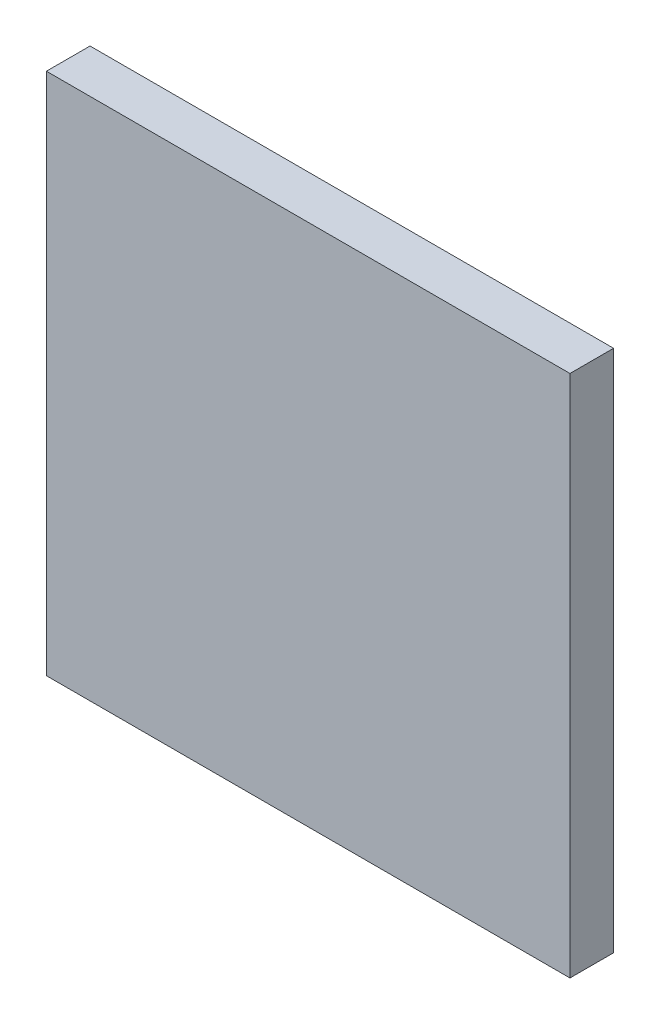
ISO-10303-21;
HEADER;
FILE_DESCRIPTION(('STEP AP214'),'2;1');
FILE_NAME('part.step','',(''),(''),'','','');
FILE_SCHEMA(('AUTOMOTIVE_DESIGN { 1 0 10303 214 1 1 1 1 }'));
ENDSEC;
DATA;
#1=APPLICATION_CONTEXT('core data for automotive mechanical design processes');
#2=APPLICATION_PROTOCOL_DEFINITION('international standard','automotive_design',2000,#1);
#3=PRODUCT_CONTEXT('',#1,'mechanical');
#4=PRODUCT('Part','Part','',(#3));
#5=PRODUCT_RELATED_PRODUCT_CATEGORY('part','',(#4));
#6=PRODUCT_DEFINITION_FORMATION('','',#4);
#7=PRODUCT_DEFINITION_CONTEXT('part definition',#1,'design');
#8=PRODUCT_DEFINITION('design','',#6,#7);
#9=PRODUCT_DEFINITION_SHAPE('','',#8);
#10=(LENGTH_UNIT() NAMED_UNIT(*) SI_UNIT(.MILLI.,.METRE.));
#11=(NAMED_UNIT(*) PLANE_ANGLE_UNIT() SI_UNIT($,.RADIAN.));
#12=(NAMED_UNIT(*) SI_UNIT($,.STERADIAN.) SOLID_ANGLE_UNIT());
#13=UNCERTAINTY_MEASURE_WITH_UNIT(LENGTH_MEASURE(1.E-05),#10,'distance_accuracy_value','');
#14=(GEOMETRIC_REPRESENTATION_CONTEXT(3) GLOBAL_UNCERTAINTY_ASSIGNED_CONTEXT((#13)) GLOBAL_UNIT_ASSIGNED_CONTEXT((#10,
#11,#12)) REPRESENTATION_CONTEXT('',''));
#15=CARTESIAN_POINT('',(0.,0.,0.));
#16=DIRECTION('',(0.,0.,1.));
#17=DIRECTION('',(1.,0.,0.));
#18=AXIS2_PLACEMENT_3D('',#15,#16,#17);
#19=CARTESIAN_POINT('',(76.2,-38.1,-3.175));
#20=DIRECTION('',(0.,0.,1.));
#21=DIRECTION('',(1.,0.,0.));
#22=AXIS2_PLACEMENT_3D('',#19,#20,#21);
#23=PLANE('',#22);
#24=DIRECTION('',(0.,1.,0.));
#25=VECTOR('',#24,1.);
#26=CARTESIAN_POINT('',(0.,-38.1,-3.175));
#27=LINE('',#26,#25);
#28=CARTESIAN_POINT('',(0.,-38.1,-3.175));
#29=VERTEX_POINT('',#28);
#30=CARTESIAN_POINT('',(0.,38.1,-3.175));
#31=VERTEX_POINT('',#30);
#32=EDGE_CURVE('E96',#29,#31,#27,.T.);
#33=ORIENTED_EDGE('',*,*,#32,.T.);
#34=DIRECTION('',(-1.,0.,0.));
#35=VECTOR('',#34,1.);
#36=CARTESIAN_POINT('',(76.2,38.1,-3.175));
#37=LINE('',#36,#35);
#38=CARTESIAN_POINT('',(76.2,38.1,-3.175));
#39=VERTEX_POINT('',#38);
#40=EDGE_CURVE('E11',#39,#31,#37,.T.);
#41=ORIENTED_EDGE('',*,*,#40,.F.);
#42=DIRECTION('',(0.,1.,0.));
#43=VECTOR('',#42,1.);
#44=CARTESIAN_POINT('',(76.2,-38.1,-3.175));
#45=LINE('',#44,#43);
#46=CARTESIAN_POINT('',(76.2,-38.1,-3.175));
#47=VERTEX_POINT('',#46);
#48=EDGE_CURVE('E84',#47,#39,#45,.T.);
#49=ORIENTED_EDGE('',*,*,#48,.F.);
#50=DIRECTION('',(-1.,0.,0.));
#51=VECTOR('',#50,1.);
#52=CARTESIAN_POINT('',(76.2,-38.1,-3.175));
#53=LINE('',#52,#51);
#54=EDGE_CURVE('E92',#47,#29,#53,.T.);
#55=ORIENTED_EDGE('',*,*,#54,.T.);
#56=EDGE_LOOP('',(#33,#41,#49,#55));
#57=FACE_BOUND('',#56,.T.);
#58=ADVANCED_FACE('F33',(#57),#23,.F.);
#59=CARTESIAN_POINT('',(76.2,38.1,3.175));
#60=DIRECTION('',(0.,-1.,0.));
#61=DIRECTION('',(0.,0.,-1.));
#62=AXIS2_PLACEMENT_3D('',#59,#60,#61);
#63=PLANE('',#62);
#64=DIRECTION('',(0.,0.,1.));
#65=VECTOR('',#64,1.);
#66=CARTESIAN_POINT('',(0.,38.1,3.175));
#67=LINE('',#66,#65);
#68=CARTESIAN_POINT('',(0.,38.1,3.175));
#69=VERTEX_POINT('',#68);
#70=EDGE_CURVE('E88',#31,#69,#67,.T.);
#71=ORIENTED_EDGE('',*,*,#70,.T.);
#72=DIRECTION('',(-1.,0.,0.));
#73=VECTOR('',#72,1.);
#74=CARTESIAN_POINT('',(76.2,38.1,3.175));
#75=LINE('',#74,#73);
#76=CARTESIAN_POINT('',(76.2,38.1,3.175));
#77=VERTEX_POINT('',#76);
#78=EDGE_CURVE('E41',#77,#69,#75,.T.);
#79=ORIENTED_EDGE('',*,*,#78,.F.);
#80=DIRECTION('',(0.,0.,1.));
#81=VECTOR('',#80,1.);
#82=CARTESIAN_POINT('',(76.2,38.1,3.175));
#83=LINE('',#82,#81);
#84=EDGE_CURVE('E79',#39,#77,#83,.T.);
#85=ORIENTED_EDGE('',*,*,#84,.F.);
#86=ORIENTED_EDGE('',*,*,#40,.T.);
#87=EDGE_LOOP('',(#71,#79,#85,#86));
#88=FACE_BOUND('',#87,.T.);
#89=ADVANCED_FACE('F87',(#88),#63,.F.);
#90=CARTESIAN_POINT('',(76.2,-38.1,3.175));
#91=DIRECTION('',(0.,0.,-1.));
#92=DIRECTION('',(-1.,0.,0.));
#93=AXIS2_PLACEMENT_3D('',#90,#91,#92);
#94=PLANE('',#93);
#95=DIRECTION('',(0.,-1.,0.));
#96=VECTOR('',#95,1.);
#97=CARTESIAN_POINT('',(0.,-38.1,3.175));
#98=LINE('',#97,#96);
#99=CARTESIAN_POINT('',(0.,-38.1,3.175));
#100=VERTEX_POINT('',#99);
#101=EDGE_CURVE('E66',#69,#100,#98,.T.);
#102=ORIENTED_EDGE('',*,*,#101,.T.);
#103=DIRECTION('',(-1.,0.,0.));
#104=VECTOR('',#103,1.);
#105=CARTESIAN_POINT('',(76.2,-38.1,3.175));
#106=LINE('',#105,#104);
#107=CARTESIAN_POINT('',(76.2,-38.1,3.175));
#108=VERTEX_POINT('',#107);
#109=EDGE_CURVE('E89',#108,#100,#106,.T.);
#110=ORIENTED_EDGE('',*,*,#109,.F.);
#111=DIRECTION('',(0.,-1.,0.));
#112=VECTOR('',#111,1.);
#113=CARTESIAN_POINT('',(76.2,-38.1,3.175));
#114=LINE('',#113,#112);
#115=EDGE_CURVE('E82',#77,#108,#114,.T.);
#116=ORIENTED_EDGE('',*,*,#115,.F.);
#117=ORIENTED_EDGE('',*,*,#78,.T.);
#118=EDGE_LOOP('',(#102,#110,#116,#117));
#119=FACE_BOUND('',#118,.T.);
#120=ADVANCED_FACE('F90',(#119),#94,.F.);
#121=CARTESIAN_POINT('',(76.2,-38.1,3.175));
#122=DIRECTION('',(0.,1.,0.));
#123=DIRECTION('',(0.,0.,1.));
#124=AXIS2_PLACEMENT_3D('',#121,#122,#123);
#125=PLANE('',#124);
#126=DIRECTION('',(0.,0.,-1.));
#127=VECTOR('',#126,1.);
#128=CARTESIAN_POINT('',(0.,-38.1,3.175));
#129=LINE('',#128,#127);
#130=EDGE_CURVE('E72',#100,#29,#129,.T.);
#131=ORIENTED_EDGE('',*,*,#130,.T.);
#132=ORIENTED_EDGE('',*,*,#54,.F.);
#133=DIRECTION('',(0.,0.,-1.));
#134=VECTOR('',#133,1.);
#135=CARTESIAN_POINT('',(76.2,-38.1,3.175));
#136=LINE('',#135,#134);
#137=EDGE_CURVE('E49',#108,#47,#136,.T.);
#138=ORIENTED_EDGE('',*,*,#137,.F.);
#139=ORIENTED_EDGE('',*,*,#109,.T.);
#140=EDGE_LOOP('',(#131,#132,#138,#139));
#141=FACE_BOUND('',#140,.T.);
#142=ADVANCED_FACE('F103',(#141),#125,.F.);
#143=CARTESIAN_POINT('',(76.2,0.,0.));
#144=DIRECTION('',(-1.,0.,0.));
#145=DIRECTION('',(0.,0.,1.));
#146=AXIS2_PLACEMENT_3D('',#143,#144,#145);
#147=PLANE('',#146);
#148=ORIENTED_EDGE('',*,*,#48,.T.);
#149=ORIENTED_EDGE('',*,*,#84,.T.);
#150=ORIENTED_EDGE('',*,*,#115,.T.);
#151=ORIENTED_EDGE('',*,*,#137,.T.);
#152=EDGE_LOOP('',(#148,#149,#150,#151));
#153=FACE_BOUND('',#152,.T.);
#154=ADVANCED_FACE('F80',(#153),#147,.F.);
#155=CARTESIAN_POINT('',(0.,0.,0.));
#156=DIRECTION('',(-1.,0.,0.));
#157=DIRECTION('',(0.,0.,1.));
#158=AXIS2_PLACEMENT_3D('',#155,#156,#157);
#159=PLANE('',#158);
#160=ORIENTED_EDGE('',*,*,#32,.F.);
#161=ORIENTED_EDGE('',*,*,#130,.F.);
#162=ORIENTED_EDGE('',*,*,#101,.F.);
#163=ORIENTED_EDGE('',*,*,#70,.F.);
#164=EDGE_LOOP('',(#160,#161,#162,#163));
#165=FACE_BOUND('',#164,.T.);
#166=ADVANCED_FACE('F106',(#165),#159,.T.);
#167=CLOSED_SHELL('',(#58,#89,#120,#142,#154,#166));
#168=MANIFOLD_SOLID_BREP('B2',#167);
#169=ADVANCED_BREP_SHAPE_REPRESENTATION('',(#18,#168),#14);
#170=SHAPE_DEFINITION_REPRESENTATION(#9,#169);
ENDSEC;
END-ISO-10303-21;
